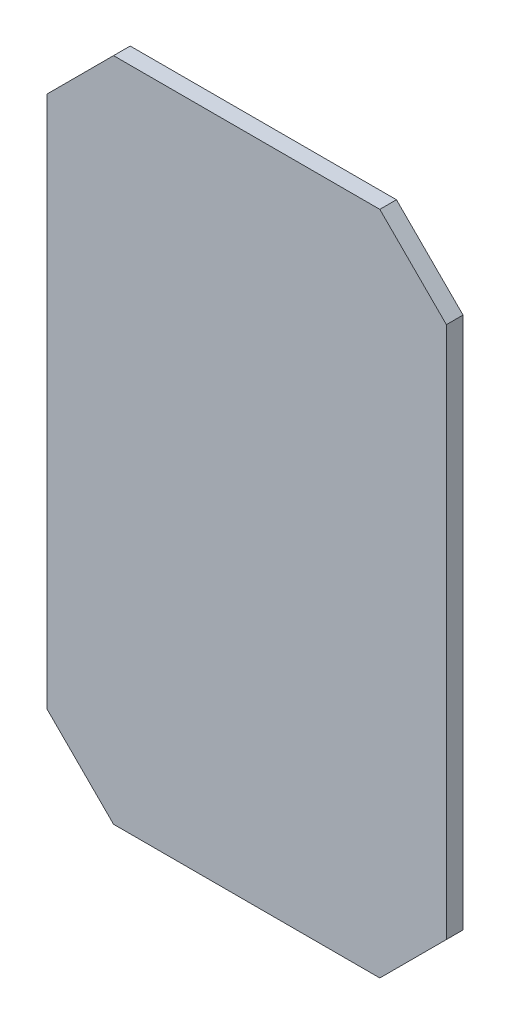
ISO-10303-21;
HEADER;
FILE_DESCRIPTION(('STEP AP214'),'2;1');
FILE_NAME('part.step','',(''),(''),'','','');
FILE_SCHEMA(('AUTOMOTIVE_DESIGN { 1 0 10303 214 1 1 1 1 }'));
ENDSEC;
DATA;
#1=APPLICATION_CONTEXT('core data for automotive mechanical design processes');
#2=APPLICATION_PROTOCOL_DEFINITION('international standard','automotive_design',2000,#1);
#3=PRODUCT_CONTEXT('',#1,'mechanical');
#4=PRODUCT('Part','Part','',(#3));
#5=PRODUCT_RELATED_PRODUCT_CATEGORY('part','',(#4));
#6=PRODUCT_DEFINITION_FORMATION('','',#4);
#7=PRODUCT_DEFINITION_CONTEXT('part definition',#1,'design');
#8=PRODUCT_DEFINITION('design','',#6,#7);
#9=PRODUCT_DEFINITION_SHAPE('','',#8);
#10=(LENGTH_UNIT() NAMED_UNIT(*) SI_UNIT(.MILLI.,.METRE.));
#11=(NAMED_UNIT(*) PLANE_ANGLE_UNIT() SI_UNIT($,.RADIAN.));
#12=(NAMED_UNIT(*) SI_UNIT($,.STERADIAN.) SOLID_ANGLE_UNIT());
#13=UNCERTAINTY_MEASURE_WITH_UNIT(LENGTH_MEASURE(1.E-05),#10,'distance_accuracy_value','');
#14=(GEOMETRIC_REPRESENTATION_CONTEXT(3) GLOBAL_UNCERTAINTY_ASSIGNED_CONTEXT((#13)) GLOBAL_UNIT_ASSIGNED_CONTEXT((#10,
#11,#12)) REPRESENTATION_CONTEXT('',''));
#15=CARTESIAN_POINT('',(0.,0.,0.));
#16=DIRECTION('',(0.,0.,1.));
#17=DIRECTION('',(1.,0.,0.));
#18=AXIS2_PLACEMENT_3D('',#15,#16,#17);
#19=CARTESIAN_POINT('',(-11.2921031479847,0.,3.175));
#20=DIRECTION('',(-0.707106781186548,0.707106781186547,0.));
#21=DIRECTION('',(-0.707106781186547,-0.707106781186548,0.));
#22=AXIS2_PLACEMENT_3D('',#19,#20,#21);
#23=PLANE('',#22);
#24=DIRECTION('',(0.707106781186547,0.707106781186548,0.));
#25=VECTOR('',#24,1.);
#26=CARTESIAN_POINT('',(-11.2921031479847,0.,0.));
#27=LINE('',#26,#25);
#28=CARTESIAN_POINT('',(-11.2921031479847,0.,0.));
#29=VERTEX_POINT('',#28);
#30=CARTESIAN_POINT('',(1.40789685201525,12.7,0.));
#31=VERTEX_POINT('',#30);
#32=EDGE_CURVE('E131',#29,#31,#27,.T.);
#33=ORIENTED_EDGE('',*,*,#32,.F.);
#34=DIRECTION('',(0.,0.,-1.));
#35=VECTOR('',#34,1.);
#36=CARTESIAN_POINT('',(-11.2921031479847,0.,3.175));
#37=LINE('',#36,#35);
#38=CARTESIAN_POINT('',(-11.2921031479847,0.,3.175));
#39=VERTEX_POINT('',#38);
#40=EDGE_CURVE('E11',#39,#29,#37,.T.);
#41=ORIENTED_EDGE('',*,*,#40,.F.);
#42=DIRECTION('',(0.707106781186547,0.707106781186548,0.));
#43=VECTOR('',#42,1.);
#44=CARTESIAN_POINT('',(-11.2921031479847,0.,3.175));
#45=LINE('',#44,#43);
#46=CARTESIAN_POINT('',(1.40789685201525,12.7,3.175));
#47=VERTEX_POINT('',#46);
#48=EDGE_CURVE('E149',#39,#47,#45,.T.);
#49=ORIENTED_EDGE('',*,*,#48,.T.);
#50=DIRECTION('',(0.,0.,-1.));
#51=VECTOR('',#50,1.);
#52=CARTESIAN_POINT('',(1.40789685201525,12.7,3.175));
#53=LINE('',#52,#51);
#54=EDGE_CURVE('E36',#47,#31,#53,.T.);
#55=ORIENTED_EDGE('',*,*,#54,.T.);
#56=EDGE_LOOP('',(#33,#41,#49,#55));
#57=FACE_BOUND('',#56,.T.);
#58=ADVANCED_FACE('F33',(#57),#23,.T.);
#59=CARTESIAN_POINT('',(-11.2921031479847,0.,3.175));
#60=DIRECTION('',(1.,0.,0.));
#61=DIRECTION('',(0.,1.,0.));
#62=AXIS2_PLACEMENT_3D('',#59,#60,#61);
#63=PLANE('',#62);
#64=DIRECTION('',(0.,-1.,0.));
#65=VECTOR('',#64,1.);
#66=CARTESIAN_POINT('',(-11.2921031479847,0.,0.));
#67=LINE('',#66,#65);
#68=CARTESIAN_POINT('',(-11.2921031479847,-101.6,0.));
#69=VERTEX_POINT('',#68);
#70=EDGE_CURVE('E78',#29,#69,#67,.T.);
#71=ORIENTED_EDGE('',*,*,#70,.T.);
#72=DIRECTION('',(0.,0.,-1.));
#73=VECTOR('',#72,1.);
#74=CARTESIAN_POINT('',(-11.2921031479847,-101.6,3.175));
#75=LINE('',#74,#73);
#76=CARTESIAN_POINT('',(-11.2921031479847,-101.6,3.175));
#77=VERTEX_POINT('',#76);
#78=EDGE_CURVE('E42',#77,#69,#75,.T.);
#79=ORIENTED_EDGE('',*,*,#78,.F.);
#80=DIRECTION('',(0.,-1.,0.));
#81=VECTOR('',#80,1.);
#82=CARTESIAN_POINT('',(-11.2921031479847,0.,3.175));
#83=LINE('',#82,#81);
#84=EDGE_CURVE('E109',#39,#77,#83,.T.);
#85=ORIENTED_EDGE('',*,*,#84,.F.);
#86=ORIENTED_EDGE('',*,*,#40,.T.);
#87=EDGE_LOOP('',(#71,#79,#85,#86));
#88=FACE_BOUND('',#87,.T.);
#89=ADVANCED_FACE('F188',(#88),#63,.F.);
#90=CARTESIAN_POINT('',(-11.2921031479847,-101.6,3.175));
#91=DIRECTION('',(0.707106781186548,0.707106781186547,0.));
#92=DIRECTION('',(-0.707106781186547,0.707106781186548,0.));
#93=AXIS2_PLACEMENT_3D('',#90,#91,#92);
#94=PLANE('',#93);
#95=DIRECTION('',(0.707106781186547,-0.707106781186548,0.));
#96=VECTOR('',#95,1.);
#97=CARTESIAN_POINT('',(-11.2921031479847,-101.6,0.));
#98=LINE('',#97,#96);
#99=CARTESIAN_POINT('',(1.40789685201527,-114.3,0.));
#100=VERTEX_POINT('',#99);
#101=EDGE_CURVE('E116',#69,#100,#98,.T.);
#102=ORIENTED_EDGE('',*,*,#101,.T.);
#103=DIRECTION('',(0.,0.,-1.));
#104=VECTOR('',#103,1.);
#105=CARTESIAN_POINT('',(1.40789685201527,-114.3,3.175));
#106=LINE('',#105,#104);
#107=CARTESIAN_POINT('',(1.40789685201527,-114.3,3.175));
#108=VERTEX_POINT('',#107);
#109=EDGE_CURVE('E113',#108,#100,#106,.T.);
#110=ORIENTED_EDGE('',*,*,#109,.F.);
#111=DIRECTION('',(0.707106781186547,-0.707106781186548,0.));
#112=VECTOR('',#111,1.);
#113=CARTESIAN_POINT('',(-11.2921031479847,-101.6,3.175));
#114=LINE('',#113,#112);
#115=EDGE_CURVE('E102',#77,#108,#114,.T.);
#116=ORIENTED_EDGE('',*,*,#115,.F.);
#117=ORIENTED_EDGE('',*,*,#78,.T.);
#118=EDGE_LOOP('',(#102,#110,#116,#117));
#119=FACE_BOUND('',#118,.T.);
#120=ADVANCED_FACE('F114',(#119),#94,.F.);
#121=CARTESIAN_POINT('',(1.40789685201527,-114.3,3.175));
#122=DIRECTION('',(0.,1.,0.));
#123=DIRECTION('',(0.,0.,1.));
#124=AXIS2_PLACEMENT_3D('',#121,#122,#123);
#125=PLANE('',#124);
#126=DIRECTION('',(1.,0.,0.));
#127=VECTOR('',#126,1.);
#128=CARTESIAN_POINT('',(1.40789685201527,-114.3,0.));
#129=LINE('',#128,#127);
#130=CARTESIAN_POINT('',(52.2078968520153,-114.3,0.));
#131=VERTEX_POINT('',#130);
#132=EDGE_CURVE('E146',#100,#131,#129,.T.);
#133=ORIENTED_EDGE('',*,*,#132,.T.);
#134=DIRECTION('',(0.,0.,-1.));
#135=VECTOR('',#134,1.);
#136=CARTESIAN_POINT('',(52.2078968520153,-114.3,3.175));
#137=LINE('',#136,#135);
#138=CARTESIAN_POINT('',(52.2078968520153,-114.3,3.175));
#139=VERTEX_POINT('',#138);
#140=EDGE_CURVE('E119',#139,#131,#137,.T.);
#141=ORIENTED_EDGE('',*,*,#140,.F.);
#142=DIRECTION('',(1.,0.,0.));
#143=VECTOR('',#142,1.);
#144=CARTESIAN_POINT('',(1.40789685201527,-114.3,3.175));
#145=LINE('',#144,#143);
#146=EDGE_CURVE('E107',#108,#139,#145,.T.);
#147=ORIENTED_EDGE('',*,*,#146,.F.);
#148=ORIENTED_EDGE('',*,*,#109,.T.);
#149=EDGE_LOOP('',(#133,#141,#147,#148));
#150=FACE_BOUND('',#149,.T.);
#151=ADVANCED_FACE('F121',(#150),#125,.F.);
#152=CARTESIAN_POINT('',(52.2078968520153,-114.3,3.175));
#153=DIRECTION('',(-0.707106781186548,0.707106781186548,0.));
#154=DIRECTION('',(-0.707106781186548,-0.707106781186548,0.));
#155=AXIS2_PLACEMENT_3D('',#152,#153,#154);
#156=PLANE('',#155);
#157=DIRECTION('',(0.707106781186547,0.707106781186547,0.));
#158=VECTOR('',#157,1.);
#159=CARTESIAN_POINT('',(52.2078968520153,-114.3,0.));
#160=LINE('',#159,#158);
#161=CARTESIAN_POINT('',(64.9078968520153,-101.6,0.));
#162=VERTEX_POINT('',#161);
#163=EDGE_CURVE('E143',#131,#162,#160,.T.);
#164=ORIENTED_EDGE('',*,*,#163,.T.);
#165=DIRECTION('',(0.,0.,-1.));
#166=VECTOR('',#165,1.);
#167=CARTESIAN_POINT('',(64.9078968520153,-101.6,3.175));
#168=LINE('',#167,#166);
#169=CARTESIAN_POINT('',(64.9078968520153,-101.6,3.175));
#170=VERTEX_POINT('',#169);
#171=EDGE_CURVE('E153',#170,#162,#168,.T.);
#172=ORIENTED_EDGE('',*,*,#171,.F.);
#173=DIRECTION('',(0.707106781186547,0.707106781186547,0.));
#174=VECTOR('',#173,1.);
#175=CARTESIAN_POINT('',(52.2078968520153,-114.3,3.175));
#176=LINE('',#175,#174);
#177=EDGE_CURVE('E124',#139,#170,#176,.T.);
#178=ORIENTED_EDGE('',*,*,#177,.F.);
#179=ORIENTED_EDGE('',*,*,#140,.T.);
#180=EDGE_LOOP('',(#164,#172,#178,#179));
#181=FACE_BOUND('',#180,.T.);
#182=ADVANCED_FACE('F163',(#181),#156,.F.);
#183=CARTESIAN_POINT('',(64.9078968520153,0.,3.175));
#184=DIRECTION('',(1.,0.,0.));
#185=DIRECTION('',(0.,1.,0.));
#186=AXIS2_PLACEMENT_3D('',#183,#184,#185);
#187=PLANE('',#186);
#188=DIRECTION('',(0.,-1.,0.));
#189=VECTOR('',#188,1.);
#190=CARTESIAN_POINT('',(64.9078968520153,0.,0.));
#191=LINE('',#190,#189);
#192=CARTESIAN_POINT('',(64.9078968520153,0.,0.));
#193=VERTEX_POINT('',#192);
#194=EDGE_CURVE('E140',#193,#162,#191,.T.);
#195=ORIENTED_EDGE('',*,*,#194,.F.);
#196=DIRECTION('',(0.,0.,-1.));
#197=VECTOR('',#196,1.);
#198=CARTESIAN_POINT('',(64.9078968520153,0.,3.175));
#199=LINE('',#198,#197);
#200=CARTESIAN_POINT('',(64.9078968520153,0.,3.175));
#201=VERTEX_POINT('',#200);
#202=EDGE_CURVE('E155',#201,#193,#199,.T.);
#203=ORIENTED_EDGE('',*,*,#202,.F.);
#204=DIRECTION('',(0.,-1.,0.));
#205=VECTOR('',#204,1.);
#206=CARTESIAN_POINT('',(64.9078968520153,0.,3.175));
#207=LINE('',#206,#205);
#208=EDGE_CURVE('E126',#201,#170,#207,.T.);
#209=ORIENTED_EDGE('',*,*,#208,.T.);
#210=ORIENTED_EDGE('',*,*,#171,.T.);
#211=EDGE_LOOP('',(#195,#203,#209,#210));
#212=FACE_BOUND('',#211,.T.);
#213=ADVANCED_FACE('F178',(#212),#187,.T.);
#214=CARTESIAN_POINT('',(52.2078968520153,12.7,3.175));
#215=DIRECTION('',(0.707106781186547,0.707106781186548,0.));
#216=DIRECTION('',(-0.707106781186548,0.707106781186547,0.));
#217=AXIS2_PLACEMENT_3D('',#214,#215,#216);
#218=PLANE('',#217);
#219=DIRECTION('',(0.707106781186548,-0.707106781186547,0.));
#220=VECTOR('',#219,1.);
#221=CARTESIAN_POINT('',(52.2078968520153,12.7,0.));
#222=LINE('',#221,#220);
#223=CARTESIAN_POINT('',(52.2078968520153,12.7,0.));
#224=VERTEX_POINT('',#223);
#225=EDGE_CURVE('E137',#224,#193,#222,.T.);
#226=ORIENTED_EDGE('',*,*,#225,.F.);
#227=DIRECTION('',(0.,0.,-1.));
#228=VECTOR('',#227,1.);
#229=CARTESIAN_POINT('',(52.2078968520153,12.7,3.175));
#230=LINE('',#229,#228);
#231=CARTESIAN_POINT('',(52.2078968520153,12.7,3.175));
#232=VERTEX_POINT('',#231);
#233=EDGE_CURVE('E156',#232,#224,#230,.T.);
#234=ORIENTED_EDGE('',*,*,#233,.F.);
#235=DIRECTION('',(0.707106781186548,-0.707106781186547,0.));
#236=VECTOR('',#235,1.);
#237=CARTESIAN_POINT('',(52.2078968520153,12.7,3.175));
#238=LINE('',#237,#236);
#239=EDGE_CURVE('E169',#232,#201,#238,.T.);
#240=ORIENTED_EDGE('',*,*,#239,.T.);
#241=ORIENTED_EDGE('',*,*,#202,.T.);
#242=EDGE_LOOP('',(#226,#234,#240,#241));
#243=FACE_BOUND('',#242,.T.);
#244=ADVANCED_FACE('F172',(#243),#218,.T.);
#245=CARTESIAN_POINT('',(1.40789685201525,12.7,3.175));
#246=DIRECTION('',(0.,1.,0.));
#247=DIRECTION('',(0.,0.,1.));
#248=AXIS2_PLACEMENT_3D('',#245,#246,#247);
#249=PLANE('',#248);
#250=DIRECTION('',(1.,0.,0.));
#251=VECTOR('',#250,1.);
#252=CARTESIAN_POINT('',(1.40789685201525,12.7,0.));
#253=LINE('',#252,#251);
#254=EDGE_CURVE('E134',#31,#224,#253,.T.);
#255=ORIENTED_EDGE('',*,*,#254,.F.);
#256=ORIENTED_EDGE('',*,*,#54,.F.);
#257=DIRECTION('',(1.,0.,0.));
#258=VECTOR('',#257,1.);
#259=CARTESIAN_POINT('',(1.40789685201525,12.7,3.175));
#260=LINE('',#259,#258);
#261=EDGE_CURVE('E174',#47,#232,#260,.T.);
#262=ORIENTED_EDGE('',*,*,#261,.T.);
#263=ORIENTED_EDGE('',*,*,#233,.T.);
#264=EDGE_LOOP('',(#255,#256,#262,#263));
#265=FACE_BOUND('',#264,.T.);
#266=ADVANCED_FACE('F158',(#265),#249,.T.);
#267=CARTESIAN_POINT('',(0.,0.,3.175));
#268=DIRECTION('',(0.,0.,-1.));
#269=DIRECTION('',(-1.,0.,0.));
#270=AXIS2_PLACEMENT_3D('',#267,#268,#269);
#271=PLANE('',#270);
#272=ORIENTED_EDGE('',*,*,#48,.F.);
#273=ORIENTED_EDGE('',*,*,#84,.T.);
#274=ORIENTED_EDGE('',*,*,#115,.T.);
#275=ORIENTED_EDGE('',*,*,#146,.T.);
#276=ORIENTED_EDGE('',*,*,#177,.T.);
#277=ORIENTED_EDGE('',*,*,#208,.F.);
#278=ORIENTED_EDGE('',*,*,#239,.F.);
#279=ORIENTED_EDGE('',*,*,#261,.F.);
#280=EDGE_LOOP('',(#272,#273,#274,#275,#276,#277,#278,#279));
#281=FACE_BOUND('',#280,.T.);
#282=ADVANCED_FACE('F105',(#281),#271,.F.);
#283=CARTESIAN_POINT('',(0.,0.,0.));
#284=DIRECTION('',(0.,0.,-1.));
#285=DIRECTION('',(-1.,0.,0.));
#286=AXIS2_PLACEMENT_3D('',#283,#284,#285);
#287=PLANE('',#286);
#288=ORIENTED_EDGE('',*,*,#32,.T.);
#289=ORIENTED_EDGE('',*,*,#254,.T.);
#290=ORIENTED_EDGE('',*,*,#225,.T.);
#291=ORIENTED_EDGE('',*,*,#194,.T.);
#292=ORIENTED_EDGE('',*,*,#163,.F.);
#293=ORIENTED_EDGE('',*,*,#132,.F.);
#294=ORIENTED_EDGE('',*,*,#101,.F.);
#295=ORIENTED_EDGE('',*,*,#70,.F.);
#296=EDGE_LOOP('',(#288,#289,#290,#291,#292,#293,#294,#295));
#297=FACE_BOUND('',#296,.T.);
#298=ADVANCED_FACE('F160',(#297),#287,.T.);
#299=CLOSED_SHELL('',(#58,#89,#120,#151,#182,#213,#244,#266,#282,#298));
#300=MANIFOLD_SOLID_BREP('B2',#299);
#301=ADVANCED_BREP_SHAPE_REPRESENTATION('',(#18,#300),#14);
#302=SHAPE_DEFINITION_REPRESENTATION(#9,#301);
ENDSEC;
END-ISO-10303-21;
